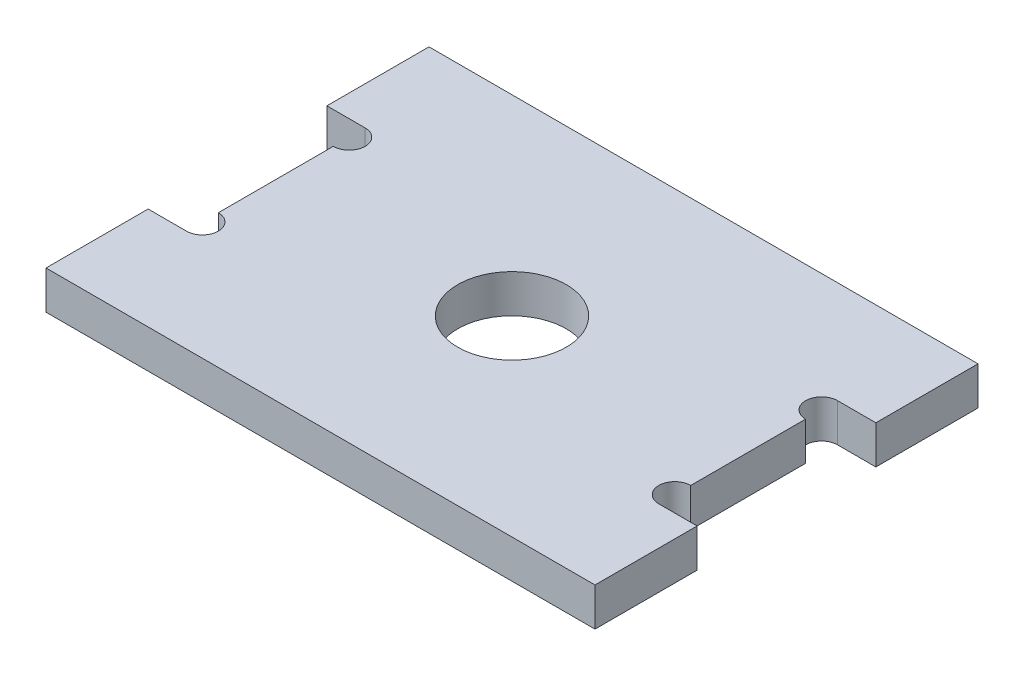
ISO-10303-21;
HEADER;
FILE_DESCRIPTION(('STEP AP214'),'2;1');
FILE_NAME('part.step','',(''),(''),'','','');
FILE_SCHEMA(('AUTOMOTIVE_DESIGN { 1 0 10303 214 1 1 1 1 }'));
ENDSEC;
DATA;
#1=APPLICATION_CONTEXT('core data for automotive mechanical design processes');
#2=APPLICATION_PROTOCOL_DEFINITION('international standard','automotive_design',2000,#1);
#3=PRODUCT_CONTEXT('',#1,'mechanical');
#4=PRODUCT('Part','Part','',(#3));
#5=PRODUCT_RELATED_PRODUCT_CATEGORY('part','',(#4));
#6=PRODUCT_DEFINITION_FORMATION('','',#4);
#7=PRODUCT_DEFINITION_CONTEXT('part definition',#1,'design');
#8=PRODUCT_DEFINITION('design','',#6,#7);
#9=PRODUCT_DEFINITION_SHAPE('','',#8);
#10=(LENGTH_UNIT() NAMED_UNIT(*) SI_UNIT(.MILLI.,.METRE.));
#11=(NAMED_UNIT(*) PLANE_ANGLE_UNIT() SI_UNIT($,.RADIAN.));
#12=(NAMED_UNIT(*) SI_UNIT($,.STERADIAN.) SOLID_ANGLE_UNIT());
#13=UNCERTAINTY_MEASURE_WITH_UNIT(LENGTH_MEASURE(1.E-05),#10,'distance_accuracy_value','');
#14=(GEOMETRIC_REPRESENTATION_CONTEXT(3) GLOBAL_UNCERTAINTY_ASSIGNED_CONTEXT((#13)) GLOBAL_UNIT_ASSIGNED_CONTEXT((#10,
#11,#12)) REPRESENTATION_CONTEXT('',''));
#15=CARTESIAN_POINT('',(0.,0.,0.));
#16=DIRECTION('',(0.,0.,1.));
#17=DIRECTION('',(1.,0.,0.));
#18=AXIS2_PLACEMENT_3D('',#15,#16,#17);
#19=CARTESIAN_POINT('',(-21.5,3.,-15.));
#20=DIRECTION('',(1.,0.,0.));
#21=DIRECTION('',(0.,0.,-1.));
#22=AXIS2_PLACEMENT_3D('',#19,#20,#21);
#23=PLANE('',#22);
#24=DIRECTION('',(0.,0.,1.));
#25=VECTOR('',#24,1.);
#26=CARTESIAN_POINT('',(-21.5,0.,-15.));
#27=LINE('',#26,#25);
#28=CARTESIAN_POINT('',(-21.5,0.,-15.));
#29=VERTEX_POINT('',#28);
#30=CARTESIAN_POINT('',(-21.5,0.,-7.));
#31=VERTEX_POINT('',#30);
#32=EDGE_CURVE('E241',#29,#31,#27,.T.);
#33=ORIENTED_EDGE('',*,*,#32,.T.);
#34=DIRECTION('',(0.,1.,0.));
#35=VECTOR('',#34,1.);
#36=CARTESIAN_POINT('',(-21.5,3.,-7.));
#37=LINE('',#36,#35);
#38=CARTESIAN_POINT('',(-21.5,3.,-7.));
#39=VERTEX_POINT('',#38);
#40=EDGE_CURVE('E11',#31,#39,#37,.T.);
#41=ORIENTED_EDGE('',*,*,#40,.T.);
#42=DIRECTION('',(0.,0.,1.));
#43=VECTOR('',#42,1.);
#44=CARTESIAN_POINT('',(-21.5,3.,-15.));
#45=LINE('',#44,#43);
#46=CARTESIAN_POINT('',(-21.5,3.,-15.));
#47=VERTEX_POINT('',#46);
#48=EDGE_CURVE('E225',#47,#39,#45,.T.);
#49=ORIENTED_EDGE('',*,*,#48,.F.);
#50=DIRECTION('',(0.,-1.,0.));
#51=VECTOR('',#50,1.);
#52=CARTESIAN_POINT('',(-21.5,3.,-15.));
#53=LINE('',#52,#51);
#54=EDGE_CURVE('E255',#47,#29,#53,.T.);
#55=ORIENTED_EDGE('',*,*,#54,.T.);
#56=EDGE_LOOP('',(#33,#41,#49,#55));
#57=FACE_BOUND('',#56,.T.);
#58=ADVANCED_FACE('F38',(#57),#23,.F.);
#59=CARTESIAN_POINT('',(21.5,3.,-15.));
#60=DIRECTION('',(-1.,0.,0.));
#61=DIRECTION('',(0.,0.,1.));
#62=AXIS2_PLACEMENT_3D('',#59,#60,#61);
#63=PLANE('',#62);
#64=DIRECTION('',(0.,0.,-1.));
#65=VECTOR('',#64,1.);
#66=CARTESIAN_POINT('',(21.5,3.,-15.));
#67=LINE('',#66,#65);
#68=CARTESIAN_POINT('',(21.5,3.,-7.));
#69=VERTEX_POINT('',#68);
#70=CARTESIAN_POINT('',(21.5,3.,-15.));
#71=VERTEX_POINT('',#70);
#72=EDGE_CURVE('E221',#69,#71,#67,.T.);
#73=ORIENTED_EDGE('',*,*,#72,.F.);
#74=DIRECTION('',(0.,-1.,0.));
#75=VECTOR('',#74,1.);
#76=CARTESIAN_POINT('',(21.5,3.,-7.));
#77=LINE('',#76,#75);
#78=CARTESIAN_POINT('',(21.5,0.,-7.));
#79=VERTEX_POINT('',#78);
#80=EDGE_CURVE('E267',#69,#79,#77,.T.);
#81=ORIENTED_EDGE('',*,*,#80,.T.);
#82=DIRECTION('',(0.,0.,-1.));
#83=VECTOR('',#82,1.);
#84=CARTESIAN_POINT('',(21.5,0.,-15.));
#85=LINE('',#84,#83);
#86=CARTESIAN_POINT('',(21.5,0.,-15.));
#87=VERTEX_POINT('',#86);
#88=EDGE_CURVE('E212',#79,#87,#85,.T.);
#89=ORIENTED_EDGE('',*,*,#88,.T.);
#90=DIRECTION('',(0.,-1.,0.));
#91=VECTOR('',#90,1.);
#92=CARTESIAN_POINT('',(21.5,3.,-15.));
#93=LINE('',#92,#91);
#94=EDGE_CURVE('E259',#71,#87,#93,.T.);
#95=ORIENTED_EDGE('',*,*,#94,.F.);
#96=EDGE_LOOP('',(#73,#81,#89,#95));
#97=FACE_BOUND('',#96,.T.);
#98=ADVANCED_FACE('F375',(#97),#63,.F.);
#99=CARTESIAN_POINT('',(0.,3.,0.));
#100=DIRECTION('',(0.,1.,0.));
#101=DIRECTION('',(0.,0.,1.));
#102=AXIS2_PLACEMENT_3D('',#99,#100,#101);
#103=PLANE('',#102);
#104=CARTESIAN_POINT('',(18.5,3.,5.75));
#105=DIRECTION('',(0.,1.,0.));
#106=DIRECTION('',(0.,0.,1.));
#107=AXIS2_PLACEMENT_3D('',#104,#105,#106);
#108=CIRCLE('',#107,1.25);
#109=CARTESIAN_POINT('',(18.5,3.,7.));
#110=VERTEX_POINT('',#109);
#111=CARTESIAN_POINT('',(18.5,3.,4.5));
#112=VERTEX_POINT('',#111);
#113=EDGE_CURVE('E165',#110,#112,#108,.F.);
#114=ORIENTED_EDGE('',*,*,#113,.T.);
#115=DIRECTION('',(0.,0.,1.));
#116=VECTOR('',#115,1.);
#117=CARTESIAN_POINT('',(18.5,3.,7.));
#118=LINE('',#117,#116);
#119=CARTESIAN_POINT('',(18.5,3.,-4.5));
#120=VERTEX_POINT('',#119);
#121=EDGE_CURVE('E172',#120,#112,#118,.T.);
#122=ORIENTED_EDGE('',*,*,#121,.F.);
#123=CARTESIAN_POINT('',(18.5,3.,-5.75));
#124=DIRECTION('',(0.,1.,0.));
#125=DIRECTION('',(0.,0.,1.));
#126=AXIS2_PLACEMENT_3D('',#123,#124,#125);
#127=CIRCLE('',#126,1.25);
#128=CARTESIAN_POINT('',(18.5,3.,-7.));
#129=VERTEX_POINT('',#128);
#130=EDGE_CURVE('E54',#120,#129,#127,.F.);
#131=ORIENTED_EDGE('',*,*,#130,.T.);
#132=DIRECTION('',(-1.,0.,0.));
#133=VECTOR('',#132,1.);
#134=CARTESIAN_POINT('',(24.5,3.,-7.));
#135=LINE('',#134,#133);
#136=EDGE_CURVE('E200',#69,#129,#135,.T.);
#137=ORIENTED_EDGE('',*,*,#136,.F.);
#138=ORIENTED_EDGE('',*,*,#72,.T.);
#139=DIRECTION('',(-1.,0.,0.));
#140=VECTOR('',#139,1.);
#141=CARTESIAN_POINT('',(-21.5,3.,-15.));
#142=LINE('',#141,#140);
#143=EDGE_CURVE('E220',#71,#47,#142,.T.);
#144=ORIENTED_EDGE('',*,*,#143,.T.);
#145=ORIENTED_EDGE('',*,*,#48,.T.);
#146=DIRECTION('',(-1.,0.,0.));
#147=VECTOR('',#146,1.);
#148=CARTESIAN_POINT('',(-24.5,3.,-7.));
#149=LINE('',#148,#147);
#150=CARTESIAN_POINT('',(-18.5,3.,-7.));
#151=VERTEX_POINT('',#150);
#152=EDGE_CURVE('E298',#151,#39,#149,.T.);
#153=ORIENTED_EDGE('',*,*,#152,.F.);
#154=CARTESIAN_POINT('',(-18.5,3.,-5.75));
#155=DIRECTION('',(0.,1.,0.));
#156=DIRECTION('',(0.,0.,1.));
#157=AXIS2_PLACEMENT_3D('',#154,#155,#156);
#158=CIRCLE('',#157,1.25);
#159=CARTESIAN_POINT('',(-18.5,3.,-4.5));
#160=VERTEX_POINT('',#159);
#161=EDGE_CURVE('E331',#151,#160,#158,.F.);
#162=ORIENTED_EDGE('',*,*,#161,.T.);
#163=DIRECTION('',(0.,0.,-1.));
#164=VECTOR('',#163,1.);
#165=CARTESIAN_POINT('',(-18.5,3.,7.));
#166=LINE('',#165,#164);
#167=CARTESIAN_POINT('',(-18.5,3.,4.5));
#168=VERTEX_POINT('',#167);
#169=EDGE_CURVE('E293',#168,#160,#166,.T.);
#170=ORIENTED_EDGE('',*,*,#169,.F.);
#171=CARTESIAN_POINT('',(-18.5,3.,5.75));
#172=DIRECTION('',(0.,1.,0.));
#173=DIRECTION('',(0.,0.,1.));
#174=AXIS2_PLACEMENT_3D('',#171,#172,#173);
#175=CIRCLE('',#174,1.25);
#176=CARTESIAN_POINT('',(-18.5,3.,7.));
#177=VERTEX_POINT('',#176);
#178=EDGE_CURVE('E62',#168,#177,#175,.F.);
#179=ORIENTED_EDGE('',*,*,#178,.T.);
#180=DIRECTION('',(1.,0.,0.));
#181=VECTOR('',#180,1.);
#182=CARTESIAN_POINT('',(-24.5,3.,7.));
#183=LINE('',#182,#181);
#184=CARTESIAN_POINT('',(-21.5,3.,7.));
#185=VERTEX_POINT('',#184);
#186=EDGE_CURVE('E292',#185,#177,#183,.T.);
#187=ORIENTED_EDGE('',*,*,#186,.F.);
#188=CARTESIAN_POINT('',(-21.5,3.,15.));
#189=VERTEX_POINT('',#188);
#190=EDGE_CURVE('E224',#185,#189,#45,.T.);
#191=ORIENTED_EDGE('',*,*,#190,.T.);
#192=DIRECTION('',(1.,0.,0.));
#193=VECTOR('',#192,1.);
#194=CARTESIAN_POINT('',(-21.5,3.,15.));
#195=LINE('',#194,#193);
#196=CARTESIAN_POINT('',(21.5,3.,15.));
#197=VERTEX_POINT('',#196);
#198=EDGE_CURVE('E229',#189,#197,#195,.T.);
#199=ORIENTED_EDGE('',*,*,#198,.T.);
#200=CARTESIAN_POINT('',(21.5,3.,7.));
#201=VERTEX_POINT('',#200);
#202=EDGE_CURVE('E216',#197,#201,#67,.T.);
#203=ORIENTED_EDGE('',*,*,#202,.T.);
#204=DIRECTION('',(1.,0.,0.));
#205=VECTOR('',#204,1.);
#206=CARTESIAN_POINT('',(24.5,3.,7.));
#207=LINE('',#206,#205);
#208=EDGE_CURVE('E196',#110,#201,#207,.T.);
#209=ORIENTED_EDGE('',*,*,#208,.F.);
#210=EDGE_LOOP('',(#114,#122,#131,#137,#138,#144,#145,#153,#162,#170,#179,#187,#191,#199,#203,#209));
#211=FACE_BOUND('',#210,.T.);
#212=CARTESIAN_POINT('',(0.,3.,0.));
#213=DIRECTION('',(0.,1.,0.));
#214=DIRECTION('',(0.,0.,1.));
#215=AXIS2_PLACEMENT_3D('',#212,#213,#214);
#216=CIRCLE('',#215,4.25);
#217=CARTESIAN_POINT('',(0.,3.,4.25));
#218=VERTEX_POINT('',#217);
#219=EDGE_CURVE('E208',#218,#218,#216,.T.);
#220=ORIENTED_EDGE('',*,*,#219,.F.);
#221=EDGE_LOOP('',(#220));
#222=FACE_BOUND('',#221,.T.);
#223=ADVANCED_FACE('F344',(#211,#222),#103,.T.);
#224=CARTESIAN_POINT('',(0.,0.,0.));
#225=DIRECTION('',(0.,1.,0.));
#226=DIRECTION('',(0.,0.,1.));
#227=AXIS2_PLACEMENT_3D('',#224,#225,#226);
#228=PLANE('',#227);
#229=DIRECTION('',(0.,0.,-1.));
#230=VECTOR('',#229,1.);
#231=CARTESIAN_POINT('',(18.5,0.,7.));
#232=LINE('',#231,#230);
#233=CARTESIAN_POINT('',(18.5,0.,4.5));
#234=VERTEX_POINT('',#233);
#235=CARTESIAN_POINT('',(18.5,0.,-4.5));
#236=VERTEX_POINT('',#235);
#237=EDGE_CURVE('E170',#234,#236,#232,.T.);
#238=ORIENTED_EDGE('',*,*,#237,.F.);
#239=CARTESIAN_POINT('',(18.5,0.,5.75));
#240=DIRECTION('',(0.,-1.,0.));
#241=DIRECTION('',(0.,0.,1.));
#242=AXIS2_PLACEMENT_3D('',#239,#240,#241);
#243=CIRCLE('',#242,1.25);
#244=CARTESIAN_POINT('',(18.5,0.,7.));
#245=VERTEX_POINT('',#244);
#246=EDGE_CURVE('E153',#245,#234,#243,.T.);
#247=ORIENTED_EDGE('',*,*,#246,.F.);
#248=DIRECTION('',(-1.,0.,0.));
#249=VECTOR('',#248,1.);
#250=CARTESIAN_POINT('',(24.5,0.,7.));
#251=LINE('',#250,#249);
#252=CARTESIAN_POINT('',(21.5,0.,7.));
#253=VERTEX_POINT('',#252);
#254=EDGE_CURVE('E181',#253,#245,#251,.T.);
#255=ORIENTED_EDGE('',*,*,#254,.F.);
#256=CARTESIAN_POINT('',(21.5,0.,15.));
#257=VERTEX_POINT('',#256);
#258=EDGE_CURVE('E233',#257,#253,#85,.T.);
#259=ORIENTED_EDGE('',*,*,#258,.F.);
#260=DIRECTION('',(1.,0.,0.));
#261=VECTOR('',#260,1.);
#262=CARTESIAN_POINT('',(-21.5,0.,15.));
#263=LINE('',#262,#261);
#264=CARTESIAN_POINT('',(-21.5,0.,15.));
#265=VERTEX_POINT('',#264);
#266=EDGE_CURVE('E245',#265,#257,#263,.T.);
#267=ORIENTED_EDGE('',*,*,#266,.F.);
#268=CARTESIAN_POINT('',(-21.5,0.,7.));
#269=VERTEX_POINT('',#268);
#270=EDGE_CURVE('E240',#269,#265,#27,.T.);
#271=ORIENTED_EDGE('',*,*,#270,.F.);
#272=DIRECTION('',(-1.,0.,0.));
#273=VECTOR('',#272,1.);
#274=CARTESIAN_POINT('',(-24.5,0.,7.));
#275=LINE('',#274,#273);
#276=CARTESIAN_POINT('',(-18.5,0.,7.));
#277=VERTEX_POINT('',#276);
#278=EDGE_CURVE('E197',#277,#269,#275,.T.);
#279=ORIENTED_EDGE('',*,*,#278,.F.);
#280=CARTESIAN_POINT('',(-18.5,0.,5.75));
#281=DIRECTION('',(0.,-1.,0.));
#282=DIRECTION('',(0.,0.,-1.));
#283=AXIS2_PLACEMENT_3D('',#280,#281,#282);
#284=CIRCLE('',#283,1.25);
#285=CARTESIAN_POINT('',(-18.5,0.,4.5));
#286=VERTEX_POINT('',#285);
#287=EDGE_CURVE('E301',#286,#277,#284,.T.);
#288=ORIENTED_EDGE('',*,*,#287,.F.);
#289=DIRECTION('',(0.,0.,1.));
#290=VECTOR('',#289,1.);
#291=CARTESIAN_POINT('',(-18.5,0.,7.));
#292=LINE('',#291,#290);
#293=CARTESIAN_POINT('',(-18.5,0.,-4.5));
#294=VERTEX_POINT('',#293);
#295=EDGE_CURVE('E313',#294,#286,#292,.T.);
#296=ORIENTED_EDGE('',*,*,#295,.F.);
#297=CARTESIAN_POINT('',(-18.5,0.,-5.75));
#298=DIRECTION('',(0.,-1.,0.));
#299=DIRECTION('',(0.,0.,-1.));
#300=AXIS2_PLACEMENT_3D('',#297,#298,#299);
#301=CIRCLE('',#300,1.25);
#302=CARTESIAN_POINT('',(-18.5,0.,-7.));
#303=VERTEX_POINT('',#302);
#304=EDGE_CURVE('E286',#303,#294,#301,.T.);
#305=ORIENTED_EDGE('',*,*,#304,.F.);
#306=DIRECTION('',(1.,0.,0.));
#307=VECTOR('',#306,1.);
#308=CARTESIAN_POINT('',(-24.5,0.,-7.));
#309=LINE('',#308,#307);
#310=EDGE_CURVE('E304',#31,#303,#309,.T.);
#311=ORIENTED_EDGE('',*,*,#310,.F.);
#312=ORIENTED_EDGE('',*,*,#32,.F.);
#313=DIRECTION('',(-1.,0.,0.));
#314=VECTOR('',#313,1.);
#315=CARTESIAN_POINT('',(-21.5,0.,-15.));
#316=LINE('',#315,#314);
#317=EDGE_CURVE('E237',#87,#29,#316,.T.);
#318=ORIENTED_EDGE('',*,*,#317,.F.);
#319=ORIENTED_EDGE('',*,*,#88,.F.);
#320=DIRECTION('',(1.,0.,0.));
#321=VECTOR('',#320,1.);
#322=CARTESIAN_POINT('',(24.5,0.,-7.));
#323=LINE('',#322,#321);
#324=CARTESIAN_POINT('',(18.5,0.,-7.));
#325=VERTEX_POINT('',#324);
#326=EDGE_CURVE('E182',#325,#79,#323,.T.);
#327=ORIENTED_EDGE('',*,*,#326,.F.);
#328=CARTESIAN_POINT('',(18.5,0.,-5.75));
#329=DIRECTION('',(0.,-1.,0.));
#330=DIRECTION('',(0.,0.,1.));
#331=AXIS2_PLACEMENT_3D('',#328,#329,#330);
#332=CIRCLE('',#331,1.25);
#333=EDGE_CURVE('E179',#236,#325,#332,.T.);
#334=ORIENTED_EDGE('',*,*,#333,.F.);
#335=EDGE_LOOP('',(#238,#247,#255,#259,#267,#271,#279,#288,#296,#305,#311,#312,#318,#319,#327,#334));
#336=FACE_BOUND('',#335,.T.);
#337=CARTESIAN_POINT('',(0.,0.,0.));
#338=DIRECTION('',(0.,1.,0.));
#339=DIRECTION('',(0.,0.,1.));
#340=AXIS2_PLACEMENT_3D('',#337,#338,#339);
#341=CIRCLE('',#340,4.25);
#342=CARTESIAN_POINT('',(0.,0.,4.25));
#343=VERTEX_POINT('',#342);
#344=EDGE_CURVE('E187',#343,#343,#341,.T.);
#345=ORIENTED_EDGE('',*,*,#344,.T.);
#346=EDGE_LOOP('',(#345));
#347=FACE_BOUND('',#346,.T.);
#348=ADVANCED_FACE('F176',(#336,#347),#228,.F.);
#349=ORIENTED_EDGE('',*,*,#258,.T.);
#350=DIRECTION('',(0.,1.,0.));
#351=VECTOR('',#350,1.);
#352=CARTESIAN_POINT('',(21.5,3.,7.));
#353=LINE('',#352,#351);
#354=EDGE_CURVE('E263',#253,#201,#353,.T.);
#355=ORIENTED_EDGE('',*,*,#354,.T.);
#356=ORIENTED_EDGE('',*,*,#202,.F.);
#357=DIRECTION('',(0.,-1.,0.));
#358=VECTOR('',#357,1.);
#359=CARTESIAN_POINT('',(21.5,3.,15.));
#360=LINE('',#359,#358);
#361=EDGE_CURVE('E232',#197,#257,#360,.T.);
#362=ORIENTED_EDGE('',*,*,#361,.T.);
#363=EDGE_LOOP('',(#349,#355,#356,#362));
#364=FACE_BOUND('',#363,.T.);
#365=ADVANCED_FACE('F40',(#364),#63,.F.);
#366=CARTESIAN_POINT('',(-21.5,3.,-15.));
#367=DIRECTION('',(0.,0.,1.));
#368=DIRECTION('',(1.,0.,0.));
#369=AXIS2_PLACEMENT_3D('',#366,#367,#368);
#370=PLANE('',#369);
#371=ORIENTED_EDGE('',*,*,#317,.T.);
#372=ORIENTED_EDGE('',*,*,#54,.F.);
#373=ORIENTED_EDGE('',*,*,#143,.F.);
#374=ORIENTED_EDGE('',*,*,#94,.T.);
#375=EDGE_LOOP('',(#371,#372,#373,#374));
#376=FACE_BOUND('',#375,.T.);
#377=ADVANCED_FACE('F372',(#376),#370,.F.);
#378=ORIENTED_EDGE('',*,*,#190,.F.);
#379=DIRECTION('',(0.,-1.,0.));
#380=VECTOR('',#379,1.);
#381=CARTESIAN_POINT('',(-21.5,3.,7.));
#382=LINE('',#381,#380);
#383=EDGE_CURVE('E47',#185,#269,#382,.T.);
#384=ORIENTED_EDGE('',*,*,#383,.T.);
#385=ORIENTED_EDGE('',*,*,#270,.T.);
#386=DIRECTION('',(0.,-1.,0.));
#387=VECTOR('',#386,1.);
#388=CARTESIAN_POINT('',(-21.5,3.,15.));
#389=LINE('',#388,#387);
#390=EDGE_CURVE('E251',#189,#265,#389,.T.);
#391=ORIENTED_EDGE('',*,*,#390,.F.);
#392=EDGE_LOOP('',(#378,#384,#385,#391));
#393=FACE_BOUND('',#392,.T.);
#394=ADVANCED_FACE('F275',(#393),#23,.F.);
#395=CARTESIAN_POINT('',(-21.5,3.,15.));
#396=DIRECTION('',(0.,0.,-1.));
#397=DIRECTION('',(-1.,0.,0.));
#398=AXIS2_PLACEMENT_3D('',#395,#396,#397);
#399=PLANE('',#398);
#400=ORIENTED_EDGE('',*,*,#266,.T.);
#401=ORIENTED_EDGE('',*,*,#361,.F.);
#402=ORIENTED_EDGE('',*,*,#198,.F.);
#403=ORIENTED_EDGE('',*,*,#390,.T.);
#404=EDGE_LOOP('',(#400,#401,#402,#403));
#405=FACE_BOUND('',#404,.T.);
#406=ADVANCED_FACE('F353',(#405),#399,.F.);
#407=CARTESIAN_POINT('',(0.,3.,0.));
#408=DIRECTION('',(0.,-1.,0.));
#409=DIRECTION('',(0.,0.,-1.));
#410=AXIS2_PLACEMENT_3D('',#407,#408,#409);
#411=CYLINDRICAL_SURFACE('',#410,4.25);
#412=ORIENTED_EDGE('',*,*,#219,.T.);
#413=EDGE_LOOP('',(#412));
#414=FACE_BOUND('',#413,.T.);
#415=ORIENTED_EDGE('',*,*,#344,.F.);
#416=EDGE_LOOP('',(#415));
#417=FACE_BOUND('',#416,.T.);
#418=ADVANCED_FACE('F401',(#414,#417),#411,.F.);
#419=CARTESIAN_POINT('',(24.5,-15.2315462117278,-7.));
#420=DIRECTION('',(0.,0.,-1.));
#421=DIRECTION('',(-1.,0.,0.));
#422=AXIS2_PLACEMENT_3D('',#419,#420,#421);
#423=PLANE('',#422);
#424=ORIENTED_EDGE('',*,*,#136,.T.);
#425=DIRECTION('',(0.,1.,0.));
#426=VECTOR('',#425,1.);
#427=CARTESIAN_POINT('',(18.5,-15.2315462117278,-7.));
#428=LINE('',#427,#426);
#429=EDGE_CURVE('E190',#325,#129,#428,.T.);
#430=ORIENTED_EDGE('',*,*,#429,.F.);
#431=ORIENTED_EDGE('',*,*,#326,.T.);
#432=ORIENTED_EDGE('',*,*,#80,.F.);
#433=EDGE_LOOP('',(#424,#430,#431,#432));
#434=FACE_BOUND('',#433,.T.);
#435=ADVANCED_FACE('F378',(#434),#423,.F.);
#436=CARTESIAN_POINT('',(24.5,-15.2315462117278,7.));
#437=DIRECTION('',(0.,0.,1.));
#438=DIRECTION('',(1.,0.,0.));
#439=AXIS2_PLACEMENT_3D('',#436,#437,#438);
#440=PLANE('',#439);
#441=ORIENTED_EDGE('',*,*,#254,.T.);
#442=DIRECTION('',(0.,1.,0.));
#443=VECTOR('',#442,1.);
#444=CARTESIAN_POINT('',(18.5,-15.2315462117278,7.));
#445=LINE('',#444,#443);
#446=EDGE_CURVE('E159',#245,#110,#445,.T.);
#447=ORIENTED_EDGE('',*,*,#446,.T.);
#448=ORIENTED_EDGE('',*,*,#208,.T.);
#449=ORIENTED_EDGE('',*,*,#354,.F.);
#450=EDGE_LOOP('',(#441,#447,#448,#449));
#451=FACE_BOUND('',#450,.T.);
#452=ADVANCED_FACE('F347',(#451),#440,.F.);
#453=CARTESIAN_POINT('',(18.5,-15.2315462117278,7.));
#454=DIRECTION('',(-1.,0.,0.));
#455=DIRECTION('',(0.,0.,1.));
#456=AXIS2_PLACEMENT_3D('',#453,#454,#455);
#457=PLANE('',#456);
#458=ORIENTED_EDGE('',*,*,#121,.T.);
#459=DIRECTION('',(0.,-1.,0.));
#460=VECTOR('',#459,1.);
#461=CARTESIAN_POINT('',(18.5,3.001,4.5));
#462=LINE('',#461,#460);
#463=EDGE_CURVE('E156',#234,#112,#462,.F.);
#464=ORIENTED_EDGE('',*,*,#463,.F.);
#465=ORIENTED_EDGE('',*,*,#237,.T.);
#466=DIRECTION('',(0.,-1.,0.));
#467=VECTOR('',#466,1.);
#468=CARTESIAN_POINT('',(18.5,3.001,-4.5));
#469=LINE('',#468,#467);
#470=EDGE_CURVE('E288',#120,#236,#469,.T.);
#471=ORIENTED_EDGE('',*,*,#470,.F.);
#472=EDGE_LOOP('',(#458,#464,#465,#471));
#473=FACE_BOUND('',#472,.T.);
#474=ADVANCED_FACE('F169',(#473),#457,.F.);
#475=CARTESIAN_POINT('',(-24.5,-15.2315462117278,-7.));
#476=DIRECTION('',(0.,0.,-1.));
#477=DIRECTION('',(-1.,0.,0.));
#478=AXIS2_PLACEMENT_3D('',#475,#476,#477);
#479=PLANE('',#478);
#480=ORIENTED_EDGE('',*,*,#310,.T.);
#481=DIRECTION('',(0.,1.,0.));
#482=VECTOR('',#481,1.);
#483=CARTESIAN_POINT('',(-18.5,-15.2315462117278,-7.));
#484=LINE('',#483,#482);
#485=EDGE_CURVE('E309',#303,#151,#484,.T.);
#486=ORIENTED_EDGE('',*,*,#485,.T.);
#487=ORIENTED_EDGE('',*,*,#152,.T.);
#488=ORIENTED_EDGE('',*,*,#40,.F.);
#489=EDGE_LOOP('',(#480,#486,#487,#488));
#490=FACE_BOUND('',#489,.T.);
#491=ADVANCED_FACE('F363',(#490),#479,.F.);
#492=CARTESIAN_POINT('',(-24.5,-15.2315462117278,7.));
#493=DIRECTION('',(0.,0.,1.));
#494=DIRECTION('',(1.,0.,0.));
#495=AXIS2_PLACEMENT_3D('',#492,#493,#494);
#496=PLANE('',#495);
#497=ORIENTED_EDGE('',*,*,#186,.T.);
#498=DIRECTION('',(0.,1.,0.));
#499=VECTOR('',#498,1.);
#500=CARTESIAN_POINT('',(-18.5,-15.2315462117278,7.));
#501=LINE('',#500,#499);
#502=EDGE_CURVE('E308',#277,#177,#501,.T.);
#503=ORIENTED_EDGE('',*,*,#502,.F.);
#504=ORIENTED_EDGE('',*,*,#278,.T.);
#505=ORIENTED_EDGE('',*,*,#383,.F.);
#506=EDGE_LOOP('',(#497,#503,#504,#505));
#507=FACE_BOUND('',#506,.T.);
#508=ADVANCED_FACE('F423',(#507),#496,.F.);
#509=CARTESIAN_POINT('',(-18.5,-15.2315462117278,7.));
#510=DIRECTION('',(1.,0.,0.));
#511=DIRECTION('',(0.,0.,-1.));
#512=AXIS2_PLACEMENT_3D('',#509,#510,#511);
#513=PLANE('',#512);
#514=ORIENTED_EDGE('',*,*,#169,.T.);
#515=DIRECTION('',(0.,-1.,0.));
#516=VECTOR('',#515,1.);
#517=CARTESIAN_POINT('',(-18.5,3.001,-4.5));
#518=LINE('',#517,#516);
#519=EDGE_CURVE('E336',#294,#160,#518,.F.);
#520=ORIENTED_EDGE('',*,*,#519,.F.);
#521=ORIENTED_EDGE('',*,*,#295,.T.);
#522=DIRECTION('',(0.,-1.,0.));
#523=VECTOR('',#522,1.);
#524=CARTESIAN_POINT('',(-18.5,3.001,4.5));
#525=LINE('',#524,#523);
#526=EDGE_CURVE('E328',#168,#286,#525,.T.);
#527=ORIENTED_EDGE('',*,*,#526,.F.);
#528=EDGE_LOOP('',(#514,#520,#521,#527));
#529=FACE_BOUND('',#528,.T.);
#530=ADVANCED_FACE('F357',(#529),#513,.F.);
#531=CARTESIAN_POINT('',(-18.5,3.001,5.75));
#532=DIRECTION('',(0.,-1.,0.));
#533=DIRECTION('',(0.,0.,-1.));
#534=AXIS2_PLACEMENT_3D('',#531,#532,#533);
#535=CYLINDRICAL_SURFACE('',#534,1.25);
#536=ORIENTED_EDGE('',*,*,#502,.T.);
#537=ORIENTED_EDGE('',*,*,#178,.F.);
#538=ORIENTED_EDGE('',*,*,#526,.T.);
#539=ORIENTED_EDGE('',*,*,#287,.T.);
#540=EDGE_LOOP('',(#536,#537,#538,#539));
#541=FACE_BOUND('',#540,.T.);
#542=ADVANCED_FACE('F358',(#541),#535,.F.);
#543=CARTESIAN_POINT('',(-18.5,3.001,-5.75));
#544=DIRECTION('',(0.,-1.,0.));
#545=DIRECTION('',(0.,0.,-1.));
#546=AXIS2_PLACEMENT_3D('',#543,#544,#545);
#547=CYLINDRICAL_SURFACE('',#546,1.25);
#548=ORIENTED_EDGE('',*,*,#519,.T.);
#549=ORIENTED_EDGE('',*,*,#161,.F.);
#550=ORIENTED_EDGE('',*,*,#485,.F.);
#551=ORIENTED_EDGE('',*,*,#304,.T.);
#552=EDGE_LOOP('',(#548,#549,#550,#551));
#553=FACE_BOUND('',#552,.T.);
#554=ADVANCED_FACE('F362',(#553),#547,.F.);
#555=CARTESIAN_POINT('',(18.5,3.001,-5.75));
#556=DIRECTION('',(0.,-1.,0.));
#557=DIRECTION('',(0.,0.,-1.));
#558=AXIS2_PLACEMENT_3D('',#555,#556,#557);
#559=CYLINDRICAL_SURFACE('',#558,1.25);
#560=ORIENTED_EDGE('',*,*,#429,.T.);
#561=ORIENTED_EDGE('',*,*,#130,.F.);
#562=ORIENTED_EDGE('',*,*,#470,.T.);
#563=ORIENTED_EDGE('',*,*,#333,.T.);
#564=EDGE_LOOP('',(#560,#561,#562,#563));
#565=FACE_BOUND('',#564,.T.);
#566=ADVANCED_FACE('F381',(#565),#559,.F.);
#567=CARTESIAN_POINT('',(18.5,3.001,5.75));
#568=DIRECTION('',(0.,-1.,0.));
#569=DIRECTION('',(0.,0.,-1.));
#570=AXIS2_PLACEMENT_3D('',#567,#568,#569);
#571=CYLINDRICAL_SURFACE('',#570,1.25);
#572=ORIENTED_EDGE('',*,*,#463,.T.);
#573=ORIENTED_EDGE('',*,*,#113,.F.);
#574=ORIENTED_EDGE('',*,*,#446,.F.);
#575=ORIENTED_EDGE('',*,*,#246,.T.);
#576=EDGE_LOOP('',(#572,#573,#574,#575));
#577=FACE_BOUND('',#576,.T.);
#578=ADVANCED_FACE('F155',(#577),#571,.F.);
#579=CLOSED_SHELL('',(#58,#98,#223,#348,#365,#377,#394,#406,#418,#435,#452,#474,#491,#508,#530,
#542,#554,#566,#578));
#580=MANIFOLD_SOLID_BREP('B2',#579);
#581=ADVANCED_BREP_SHAPE_REPRESENTATION('',(#18,#580),#14);
#582=SHAPE_DEFINITION_REPRESENTATION(#9,#581);
ENDSEC;
END-ISO-10303-21;
